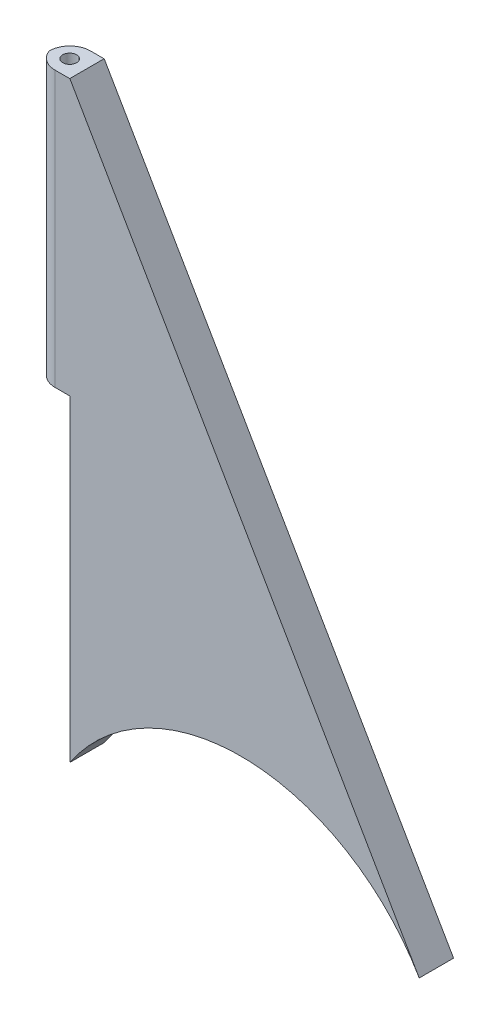
ISO-10303-21;
HEADER;
FILE_DESCRIPTION(('STEP AP214'),'2;1');
FILE_NAME('part.step','',(''),(''),'','','');
FILE_SCHEMA(('AUTOMOTIVE_DESIGN { 1 0 10303 214 1 1 1 1 }'));
ENDSEC;
DATA;
#1=APPLICATION_CONTEXT('core data for automotive mechanical design processes');
#2=APPLICATION_PROTOCOL_DEFINITION('international standard','automotive_design',2000,#1);
#3=PRODUCT_CONTEXT('',#1,'mechanical');
#4=PRODUCT('Part','Part','',(#3));
#5=PRODUCT_RELATED_PRODUCT_CATEGORY('part','',(#4));
#6=PRODUCT_DEFINITION_FORMATION('','',#4);
#7=PRODUCT_DEFINITION_CONTEXT('part definition',#1,'design');
#8=PRODUCT_DEFINITION('design','',#6,#7);
#9=PRODUCT_DEFINITION_SHAPE('','',#8);
#10=(LENGTH_UNIT() NAMED_UNIT(*) SI_UNIT(.MILLI.,.METRE.));
#11=(NAMED_UNIT(*) PLANE_ANGLE_UNIT() SI_UNIT($,.RADIAN.));
#12=(NAMED_UNIT(*) SI_UNIT($,.STERADIAN.) SOLID_ANGLE_UNIT());
#13=UNCERTAINTY_MEASURE_WITH_UNIT(LENGTH_MEASURE(1.E-05),#10,'distance_accuracy_value','');
#14=(GEOMETRIC_REPRESENTATION_CONTEXT(3) GLOBAL_UNCERTAINTY_ASSIGNED_CONTEXT((#13)) GLOBAL_UNIT_ASSIGNED_CONTEXT((#10,
#11,#12)) REPRESENTATION_CONTEXT('',''));
#15=CARTESIAN_POINT('',(0.,0.,0.));
#16=DIRECTION('',(0.,0.,1.));
#17=DIRECTION('',(1.,0.,0.));
#18=AXIS2_PLACEMENT_3D('',#15,#16,#17);
#19=CARTESIAN_POINT('',(-24.8298059769717,87.5088118938212,5.));
#20=DIRECTION('',(1.,0.,0.));
#21=DIRECTION('',(0.,0.,-1.));
#22=AXIS2_PLACEMENT_3D('',#19,#20,#21);
#23=PLANE('',#22);
#24=DIRECTION('',(0.,0.,-1.));
#25=VECTOR('',#24,1.);
#26=CARTESIAN_POINT('',(-24.8298059769717,87.4898844982201,5.));
#27=LINE('',#26,#25);
#28=CARTESIAN_POINT('',(-24.8298059769717,87.4898844982201,5.));
#29=VERTEX_POINT('',#28);
#30=CARTESIAN_POINT('',(-24.8298059769717,87.4898844982201,0.));
#31=VERTEX_POINT('',#30);
#32=EDGE_CURVE('E164',#29,#31,#27,.T.);
#33=ORIENTED_EDGE('',*,*,#32,.F.);
#34=DIRECTION('',(0.,-1.,0.));
#35=VECTOR('',#34,1.);
#36=CARTESIAN_POINT('',(-24.8298059769717,87.5088118938212,5.));
#37=LINE('',#36,#35);
#38=CARTESIAN_POINT('',(-24.8298059769717,87.5088118938212,5.));
#39=VERTEX_POINT('',#38);
#40=EDGE_CURVE('E116',#39,#29,#37,.T.);
#41=ORIENTED_EDGE('',*,*,#40,.F.);
#42=DIRECTION('',(0.,0.,-1.));
#43=VECTOR('',#42,1.);
#44=CARTESIAN_POINT('',(-24.8298059769717,87.5088118938212,5.));
#45=LINE('',#44,#43);
#46=CARTESIAN_POINT('',(-24.8298059769717,87.5088118938212,0.));
#47=VERTEX_POINT('',#46);
#48=EDGE_CURVE('E139',#39,#47,#45,.T.);
#49=ORIENTED_EDGE('',*,*,#48,.T.);
#50=DIRECTION('',(0.,-1.,0.));
#51=VECTOR('',#50,1.);
#52=CARTESIAN_POINT('',(-24.8298059769717,87.5088118938212,0.));
#53=LINE('',#52,#51);
#54=EDGE_CURVE('E132',#47,#31,#53,.T.);
#55=ORIENTED_EDGE('',*,*,#54,.T.);
#56=EDGE_LOOP('',(#33,#41,#49,#55));
#57=FACE_BOUND('',#56,.T.);
#58=ADVANCED_FACE('F33',(#57),#23,.F.);
#59=CARTESIAN_POINT('',(26.0250210520275,-0.447992933347607,5.));
#60=DIRECTION('',(-0.865714362691107,-0.500538352407016,0.));
#61=DIRECTION('',(0.500538352407016,-0.865714362691107,0.));
#62=AXIS2_PLACEMENT_3D('',#59,#60,#61);
#63=PLANE('',#62);
#64=DIRECTION('',(-0.500538352407016,0.865714362691107,0.));
#65=VECTOR('',#64,1.);
#66=CARTESIAN_POINT('',(26.0250210520275,-0.447992933347607,0.));
#67=LINE('',#66,#65);
#68=CARTESIAN_POINT('',(26.0250210520275,-0.447992933347605,0.));
#69=VERTEX_POINT('',#68);
#70=EDGE_CURVE('E128',#69,#47,#67,.T.);
#71=ORIENTED_EDGE('',*,*,#70,.T.);
#72=ORIENTED_EDGE('',*,*,#48,.F.);
#73=DIRECTION('',(-0.500538352407016,0.865714362691107,0.));
#74=VECTOR('',#73,1.);
#75=CARTESIAN_POINT('',(26.0250210520275,-0.447992933347607,5.));
#76=LINE('',#75,#74);
#77=CARTESIAN_POINT('',(26.0250210520275,-0.447992933347605,5.));
#78=VERTEX_POINT('',#77);
#79=EDGE_CURVE('E117',#78,#39,#76,.T.);
#80=ORIENTED_EDGE('',*,*,#79,.F.);
#81=DIRECTION('',(0.,0.,-1.));
#82=VECTOR('',#81,1.);
#83=CARTESIAN_POINT('',(26.0250210520275,-0.447992933347605,5.));
#84=LINE('',#83,#82);
#85=EDGE_CURVE('E127',#78,#69,#84,.T.);
#86=ORIENTED_EDGE('',*,*,#85,.T.);
#87=EDGE_LOOP('',(#71,#72,#80,#86));
#88=FACE_BOUND('',#87,.T.);
#89=ADVANCED_FACE('F191',(#88),#63,.F.);
#90=CARTESIAN_POINT('',(-24.8298059769717,47.4898844982201,5.));
#91=VERTEX_POINT('',#90);
#92=CARTESIAN_POINT('',(-24.8298059769717,1.29343973691645,5.));
#93=VERTEX_POINT('',#92);
#94=EDGE_CURVE('E98',#91,#93,#37,.T.);
#95=ORIENTED_EDGE('',*,*,#94,.F.);
#96=DIRECTION('',(0.,0.,-1.));
#97=VECTOR('',#96,1.);
#98=CARTESIAN_POINT('',(-24.8298059769717,47.4898844982201,5.));
#99=LINE('',#98,#97);
#100=CARTESIAN_POINT('',(-24.8298059769717,47.4898844982201,0.));
#101=VERTEX_POINT('',#100);
#102=EDGE_CURVE('E102',#91,#101,#99,.T.);
#103=ORIENTED_EDGE('',*,*,#102,.T.);
#104=CARTESIAN_POINT('',(-24.8298059769717,1.29343973691645,0.));
#105=VERTEX_POINT('',#104);
#106=EDGE_CURVE('E131',#101,#105,#53,.T.);
#107=ORIENTED_EDGE('',*,*,#106,.T.);
#108=DIRECTION('',(0.,0.,-1.));
#109=VECTOR('',#108,1.);
#110=CARTESIAN_POINT('',(-24.8298059769717,1.29343973691645,5.));
#111=LINE('',#110,#109);
#112=EDGE_CURVE('E114',#93,#105,#111,.T.);
#113=ORIENTED_EDGE('',*,*,#112,.F.);
#114=EDGE_LOOP('',(#95,#103,#107,#113));
#115=FACE_BOUND('',#114,.T.);
#116=ADVANCED_FACE('F112',(#115),#23,.F.);
#117=CARTESIAN_POINT('',(0.0535901712942575,-15.4641435055581,5.));
#118=DIRECTION('',(0.,0.,-1.));
#119=DIRECTION('',(-1.,0.,0.));
#120=AXIS2_PLACEMENT_3D('',#117,#118,#119);
#121=CYLINDRICAL_SURFACE('',#120,30.);
#122=CARTESIAN_POINT('',(0.0535901712942575,-15.4641435055581,0.));
#123=DIRECTION('',(0.,0.,1.));
#124=DIRECTION('',(1.,0.,0.));
#125=AXIS2_PLACEMENT_3D('',#122,#123,#124);
#126=CIRCLE('',#125,30.);
#127=EDGE_CURVE('E122',#69,#105,#126,.T.);
#128=ORIENTED_EDGE('',*,*,#127,.F.);
#129=ORIENTED_EDGE('',*,*,#85,.F.);
#130=CARTESIAN_POINT('',(0.0535901712942575,-15.4641435055581,5.));
#131=DIRECTION('',(0.,0.,1.));
#132=DIRECTION('',(1.,0.,0.));
#133=AXIS2_PLACEMENT_3D('',#130,#131,#132);
#134=CIRCLE('',#133,30.);
#135=EDGE_CURVE('E120',#78,#93,#134,.T.);
#136=ORIENTED_EDGE('',*,*,#135,.T.);
#137=ORIENTED_EDGE('',*,*,#112,.T.);
#138=EDGE_LOOP('',(#128,#129,#136,#137));
#139=FACE_BOUND('',#138,.T.);
#140=ADVANCED_FACE('F201',(#139),#121,.F.);
#141=CARTESIAN_POINT('',(0.0535901712942575,-15.4641435055581,5.));
#142=DIRECTION('',(0.,0.,1.));
#143=DIRECTION('',(1.,0.,0.));
#144=AXIS2_PLACEMENT_3D('',#141,#142,#143);
#145=PLANE('',#144);
#146=DIRECTION('',(1.,0.,0.));
#147=VECTOR('',#146,1.);
#148=CARTESIAN_POINT('',(-24.8298059769717,87.4898844982201,5.));
#149=LINE('',#148,#147);
#150=CARTESIAN_POINT('',(-27.0013788522255,87.4898844982201,5.));
#151=VERTEX_POINT('',#150);
#152=EDGE_CURVE('E165',#151,#29,#149,.T.);
#153=ORIENTED_EDGE('',*,*,#152,.F.);
#154=DIRECTION('',(0.,-1.,0.));
#155=VECTOR('',#154,1.);
#156=CARTESIAN_POINT('',(-27.0013788522255,47.4898844982201,5.));
#157=LINE('',#156,#155);
#158=CARTESIAN_POINT('',(-27.0013788522255,47.4898844982201,5.));
#159=VERTEX_POINT('',#158);
#160=EDGE_CURVE('E41',#151,#159,#157,.T.);
#161=ORIENTED_EDGE('',*,*,#160,.T.);
#162=DIRECTION('',(1.,0.,0.));
#163=VECTOR('',#162,1.);
#164=CARTESIAN_POINT('',(-24.8298059769717,47.4898844982201,5.));
#165=LINE('',#164,#163);
#166=EDGE_CURVE('E93',#159,#91,#165,.T.);
#167=ORIENTED_EDGE('',*,*,#166,.T.);
#168=ORIENTED_EDGE('',*,*,#94,.T.);
#169=ORIENTED_EDGE('',*,*,#135,.F.);
#170=ORIENTED_EDGE('',*,*,#79,.T.);
#171=ORIENTED_EDGE('',*,*,#40,.T.);
#172=EDGE_LOOP('',(#153,#161,#167,#168,#169,#170,#171));
#173=FACE_BOUND('',#172,.T.);
#174=ADVANCED_FACE('F95',(#173),#145,.T.);
#175=CARTESIAN_POINT('',(0.0535901712942575,-15.4641435055581,0.));
#176=DIRECTION('',(0.,0.,1.));
#177=DIRECTION('',(1.,0.,0.));
#178=AXIS2_PLACEMENT_3D('',#175,#176,#177);
#179=PLANE('',#178);
#180=DIRECTION('',(-1.,0.,0.));
#181=VECTOR('',#180,1.);
#182=CARTESIAN_POINT('',(-24.8298059769717,47.4898844982201,0.));
#183=LINE('',#182,#181);
#184=CARTESIAN_POINT('',(-26.8298059769717,47.4898844982201,0.));
#185=VERTEX_POINT('',#184);
#186=EDGE_CURVE('E108',#101,#185,#183,.T.);
#187=ORIENTED_EDGE('',*,*,#186,.T.);
#188=DIRECTION('',(0.,1.,0.));
#189=VECTOR('',#188,1.);
#190=CARTESIAN_POINT('',(-26.8298059769717,87.4898844982201,0.));
#191=LINE('',#190,#189);
#192=CARTESIAN_POINT('',(-26.8298059769717,87.4898844982201,0.));
#193=VERTEX_POINT('',#192);
#194=EDGE_CURVE('E142',#185,#193,#191,.T.);
#195=ORIENTED_EDGE('',*,*,#194,.T.);
#196=DIRECTION('',(-1.,0.,0.));
#197=VECTOR('',#196,1.);
#198=CARTESIAN_POINT('',(-24.8298059769717,87.4898844982201,0.));
#199=LINE('',#198,#197);
#200=EDGE_CURVE('E103',#31,#193,#199,.T.);
#201=ORIENTED_EDGE('',*,*,#200,.F.);
#202=ORIENTED_EDGE('',*,*,#54,.F.);
#203=ORIENTED_EDGE('',*,*,#70,.F.);
#204=ORIENTED_EDGE('',*,*,#127,.T.);
#205=ORIENTED_EDGE('',*,*,#106,.F.);
#206=EDGE_LOOP('',(#187,#195,#201,#202,#203,#204,#205));
#207=FACE_BOUND('',#206,.T.);
#208=ADVANCED_FACE('F157',(#207),#179,.F.);
#209=CARTESIAN_POINT('',(0.,47.4898844982201,0.));
#210=DIRECTION('',(0.,-1.,0.));
#211=DIRECTION('',(0.,0.,-1.));
#212=AXIS2_PLACEMENT_3D('',#209,#210,#211);
#213=PLANE('',#212);
#214=CARTESIAN_POINT('',(-27.353173819427,47.4898844982201,2.5));
#215=DIRECTION('',(0.,1.,0.));
#216=DIRECTION('',(0.,0.,1.));
#217=AXIS2_PLACEMENT_3D('',#214,#215,#216);
#218=CIRCLE('',#217,1.00933242744425);
#219=CARTESIAN_POINT('',(-27.353173819427,47.4898844982201,3.50933242744425));
#220=VERTEX_POINT('',#219);
#221=EDGE_CURVE('E168',#220,#220,#218,.T.);
#222=ORIENTED_EDGE('',*,*,#221,.T.);
#223=EDGE_LOOP('',(#222));
#224=FACE_BOUND('',#223,.T.);
#225=ORIENTED_EDGE('',*,*,#166,.F.);
#226=CARTESIAN_POINT('',(-27.0013788522255,47.4898844982201,2.));
#227=DIRECTION('',(0.,-1.,0.));
#228=DIRECTION('',(0.,0.,-1.));
#229=AXIS2_PLACEMENT_3D('',#226,#227,#228);
#230=CIRCLE('',#229,3.);
#231=CARTESIAN_POINT('',(-29.8298059769717,47.4898844982201,3.));
#232=VERTEX_POINT('',#231);
#233=EDGE_CURVE('E11',#159,#232,#230,.T.);
#234=ORIENTED_EDGE('',*,*,#233,.T.);
#235=CARTESIAN_POINT('',(-26.8298059769717,47.4898844982201,3.));
#236=DIRECTION('',(0.,-1.,0.));
#237=DIRECTION('',(0.,0.,-1.));
#238=AXIS2_PLACEMENT_3D('',#235,#236,#237);
#239=CIRCLE('',#238,3.);
#240=EDGE_CURVE('E150',#232,#185,#239,.T.);
#241=ORIENTED_EDGE('',*,*,#240,.T.);
#242=ORIENTED_EDGE('',*,*,#186,.F.);
#243=ORIENTED_EDGE('',*,*,#102,.F.);
#244=EDGE_LOOP('',(#225,#234,#241,#242,#243));
#245=FACE_BOUND('',#244,.T.);
#246=ADVANCED_FACE('F106',(#224,#245),#213,.T.);
#247=CARTESIAN_POINT('',(0.,87.4898844982201,0.));
#248=DIRECTION('',(0.,-1.,0.));
#249=DIRECTION('',(0.,0.,-1.));
#250=AXIS2_PLACEMENT_3D('',#247,#248,#249);
#251=PLANE('',#250);
#252=CARTESIAN_POINT('',(-27.353173819427,87.4898844982201,2.5));
#253=DIRECTION('',(0.,1.,0.));
#254=DIRECTION('',(0.,0.,1.));
#255=AXIS2_PLACEMENT_3D('',#252,#253,#254);
#256=CIRCLE('',#255,1.00933242744425);
#257=CARTESIAN_POINT('',(-27.353173819427,87.4898844982201,3.50933242744425));
#258=VERTEX_POINT('',#257);
#259=EDGE_CURVE('E170',#258,#258,#256,.T.);
#260=ORIENTED_EDGE('',*,*,#259,.F.);
#261=EDGE_LOOP('',(#260));
#262=FACE_BOUND('',#261,.T.);
#263=CARTESIAN_POINT('',(-26.8298059769717,87.4898844982201,3.));
#264=DIRECTION('',(0.,-1.,0.));
#265=DIRECTION('',(0.,0.,-1.));
#266=AXIS2_PLACEMENT_3D('',#263,#264,#265);
#267=CIRCLE('',#266,3.);
#268=CARTESIAN_POINT('',(-29.8298059769717,87.4898844982201,3.));
#269=VERTEX_POINT('',#268);
#270=EDGE_CURVE('E145',#193,#269,#267,.F.);
#271=ORIENTED_EDGE('',*,*,#270,.T.);
#272=CARTESIAN_POINT('',(-27.0013788522255,87.4898844982201,2.));
#273=DIRECTION('',(0.,-1.,0.));
#274=DIRECTION('',(0.,0.,-1.));
#275=AXIS2_PLACEMENT_3D('',#272,#273,#274);
#276=CIRCLE('',#275,3.);
#277=EDGE_CURVE('E55',#269,#151,#276,.F.);
#278=ORIENTED_EDGE('',*,*,#277,.T.);
#279=ORIENTED_EDGE('',*,*,#152,.T.);
#280=ORIENTED_EDGE('',*,*,#32,.T.);
#281=ORIENTED_EDGE('',*,*,#200,.T.);
#282=EDGE_LOOP('',(#271,#278,#279,#280,#281));
#283=FACE_BOUND('',#282,.T.);
#284=ADVANCED_FACE('F161',(#262,#283),#251,.F.);
#285=CARTESIAN_POINT('',(-27.353173819427,47.4898844982201,2.5));
#286=DIRECTION('',(0.,1.,0.));
#287=DIRECTION('',(0.,0.,1.));
#288=AXIS2_PLACEMENT_3D('',#285,#286,#287);
#289=CYLINDRICAL_SURFACE('',#288,1.00933242744425);
#290=ORIENTED_EDGE('',*,*,#221,.F.);
#291=EDGE_LOOP('',(#290));
#292=FACE_BOUND('',#291,.T.);
#293=ORIENTED_EDGE('',*,*,#259,.T.);
#294=EDGE_LOOP('',(#293));
#295=FACE_BOUND('',#294,.T.);
#296=ADVANCED_FACE('F177',(#292,#295),#289,.F.);
#297=CARTESIAN_POINT('',(-26.8298059769717,-15.4641435055581,3.));
#298=DIRECTION('',(0.,-1.,0.));
#299=DIRECTION('',(0.,0.,-1.));
#300=AXIS2_PLACEMENT_3D('',#297,#298,#299);
#301=CYLINDRICAL_SURFACE('',#300,3.);
#302=ORIENTED_EDGE('',*,*,#240,.F.);
#303=DIRECTION('',(0.,1.,0.));
#304=VECTOR('',#303,1.);
#305=CARTESIAN_POINT('',(-29.8298059769717,47.4898844982201,3.));
#306=LINE('',#305,#304);
#307=EDGE_CURVE('E147',#269,#232,#306,.F.);
#308=ORIENTED_EDGE('',*,*,#307,.F.);
#309=ORIENTED_EDGE('',*,*,#270,.F.);
#310=ORIENTED_EDGE('',*,*,#194,.F.);
#311=EDGE_LOOP('',(#302,#308,#309,#310));
#312=FACE_BOUND('',#311,.T.);
#313=ADVANCED_FACE('F160',(#312),#301,.T.);
#314=CARTESIAN_POINT('',(-27.0013788522255,47.4898844982201,2.));
#315=DIRECTION('',(0.,1.,0.));
#316=DIRECTION('',(0.,0.,1.));
#317=AXIS2_PLACEMENT_3D('',#314,#315,#316);
#318=CYLINDRICAL_SURFACE('',#317,3.);
#319=ORIENTED_EDGE('',*,*,#233,.F.);
#320=ORIENTED_EDGE('',*,*,#160,.F.);
#321=ORIENTED_EDGE('',*,*,#277,.F.);
#322=ORIENTED_EDGE('',*,*,#307,.T.);
#323=EDGE_LOOP('',(#319,#320,#321,#322));
#324=FACE_BOUND('',#323,.T.);
#325=ADVANCED_FACE('F35',(#324),#318,.T.);
#326=CLOSED_SHELL('',(#58,#89,#116,#140,#174,#208,#246,#284,#296,#313,#325));
#327=MANIFOLD_SOLID_BREP('B2',#326);
#328=ADVANCED_BREP_SHAPE_REPRESENTATION('',(#18,#327),#14);
#329=SHAPE_DEFINITION_REPRESENTATION(#9,#328);
ENDSEC;
END-ISO-10303-21;
